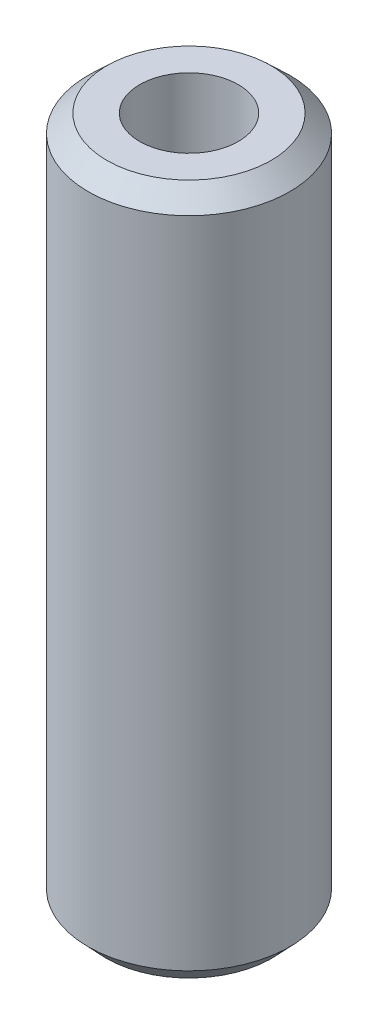
ISO-10303-21;
HEADER;
FILE_DESCRIPTION(('STEP AP214'),'2;1');
FILE_NAME('part.step','',(''),(''),'','','');
FILE_SCHEMA(('AUTOMOTIVE_DESIGN { 1 0 10303 214 1 1 1 1 }'));
ENDSEC;
DATA;
#1=APPLICATION_CONTEXT('core data for automotive mechanical design processes');
#2=APPLICATION_PROTOCOL_DEFINITION('international standard','automotive_design',2000,#1);
#3=PRODUCT_CONTEXT('',#1,'mechanical');
#4=PRODUCT('Part','Part','',(#3));
#5=PRODUCT_RELATED_PRODUCT_CATEGORY('part','',(#4));
#6=PRODUCT_DEFINITION_FORMATION('','',#4);
#7=PRODUCT_DEFINITION_CONTEXT('part definition',#1,'design');
#8=PRODUCT_DEFINITION('design','',#6,#7);
#9=PRODUCT_DEFINITION_SHAPE('','',#8);
#10=(LENGTH_UNIT() NAMED_UNIT(*) SI_UNIT(.MILLI.,.METRE.));
#11=(NAMED_UNIT(*) PLANE_ANGLE_UNIT() SI_UNIT($,.RADIAN.));
#12=(NAMED_UNIT(*) SI_UNIT($,.STERADIAN.) SOLID_ANGLE_UNIT());
#13=UNCERTAINTY_MEASURE_WITH_UNIT(LENGTH_MEASURE(1.E-05),#10,'distance_accuracy_value','');
#14=(GEOMETRIC_REPRESENTATION_CONTEXT(3) GLOBAL_UNCERTAINTY_ASSIGNED_CONTEXT((#13)) GLOBAL_UNIT_ASSIGNED_CONTEXT((#10,
#11,#12)) REPRESENTATION_CONTEXT('',''));
#15=CARTESIAN_POINT('',(0.,0.,0.));
#16=DIRECTION('',(0.,0.,1.));
#17=DIRECTION('',(1.,0.,0.));
#18=AXIS2_PLACEMENT_3D('',#15,#16,#17);
#19=CARTESIAN_POINT('',(0.,102.705654889355,0.));
#20=DIRECTION('',(0.,-1.,0.));
#21=DIRECTION('',(0.,0.,-1.));
#22=AXIS2_PLACEMENT_3D('',#19,#20,#21);
#23=CYLINDRICAL_SURFACE('',#22,15.);
#24=CARTESIAN_POINT('',(0.,100.076653163763,0.));
#25=DIRECTION('',(0.,1.,0.));
#26=DIRECTION('',(0.,0.,1.));
#27=AXIS2_PLACEMENT_3D('',#24,#25,#26);
#28=CIRCLE('',#27,15.);
#29=CARTESIAN_POINT('',(0.,100.076653163763,15.));
#30=VERTEX_POINT('',#29);
#31=EDGE_CURVE('E50',#30,#30,#28,.F.);
#32=ORIENTED_EDGE('',*,*,#31,.T.);
#33=EDGE_LOOP('',(#32));
#34=FACE_BOUND('',#33,.T.);
#35=CARTESIAN_POINT('',(0.,2.78154389514559,0.));
#36=DIRECTION('',(0.,1.,0.));
#37=DIRECTION('',(0.,0.,1.));
#38=AXIS2_PLACEMENT_3D('',#35,#36,#37);
#39=CIRCLE('',#38,15.);
#40=CARTESIAN_POINT('',(0.,2.78154389514559,15.));
#41=VERTEX_POINT('',#40);
#42=EDGE_CURVE('E51',#41,#41,#39,.T.);
#43=ORIENTED_EDGE('',*,*,#42,.T.);
#44=EDGE_LOOP('',(#43));
#45=FACE_BOUND('',#44,.T.);
#46=ADVANCED_FACE('F39',(#34,#45),#23,.T.);
#47=CARTESIAN_POINT('',(0.,102.705654889355,0.));
#48=DIRECTION('',(0.,1.,0.));
#49=DIRECTION('',(0.,0.,1.));
#50=AXIS2_PLACEMENT_3D('',#47,#48,#49);
#51=PLANE('',#50);
#52=CARTESIAN_POINT('',(0.,102.705654889355,0.));
#53=DIRECTION('',(0.,1.,0.));
#54=DIRECTION('',(0.,0.,1.));
#55=AXIS2_PLACEMENT_3D('',#52,#53,#54);
#56=CIRCLE('',#55,12.2184561048544);
#57=CARTESIAN_POINT('',(0.,102.705654889355,12.2184561048544));
#58=VERTEX_POINT('',#57);
#59=EDGE_CURVE('E54',#58,#58,#56,.T.);
#60=ORIENTED_EDGE('',*,*,#59,.T.);
#61=EDGE_LOOP('',(#60));
#62=FACE_BOUND('',#61,.T.);
#63=CARTESIAN_POINT('',(0.,102.705654889355,0.));
#64=DIRECTION('',(0.,1.,0.));
#65=DIRECTION('',(0.,0.,1.));
#66=AXIS2_PLACEMENT_3D('',#63,#64,#65);
#67=CIRCLE('',#66,7.33713232869713);
#68=CARTESIAN_POINT('',(0.,102.705654889355,7.33713232869713));
#69=VERTEX_POINT('',#68);
#70=EDGE_CURVE('E58',#69,#69,#67,.T.);
#71=ORIENTED_EDGE('',*,*,#70,.F.);
#72=EDGE_LOOP('',(#71));
#73=FACE_BOUND('',#72,.T.);
#74=ADVANCED_FACE('F69',(#62,#73),#51,.T.);
#75=CARTESIAN_POINT('',(0.,0.,0.));
#76=DIRECTION('',(0.,1.,0.));
#77=DIRECTION('',(0.,0.,1.));
#78=AXIS2_PLACEMENT_3D('',#75,#76,#77);
#79=PLANE('',#78);
#80=CARTESIAN_POINT('',(0.,0.,0.));
#81=DIRECTION('',(0.,1.,0.));
#82=DIRECTION('',(0.,0.,1.));
#83=AXIS2_PLACEMENT_3D('',#80,#81,#82);
#84=CIRCLE('',#83,12.3709982744074);
#85=CARTESIAN_POINT('',(0.,0.,12.3709982744074));
#86=VERTEX_POINT('',#85);
#87=EDGE_CURVE('E10',#86,#86,#84,.F.);
#88=ORIENTED_EDGE('',*,*,#87,.T.);
#89=EDGE_LOOP('',(#88));
#90=FACE_BOUND('',#89,.T.);
#91=CARTESIAN_POINT('',(0.,0.,0.));
#92=DIRECTION('',(0.,1.,0.));
#93=DIRECTION('',(0.,0.,1.));
#94=AXIS2_PLACEMENT_3D('',#91,#92,#93);
#95=CIRCLE('',#94,7.33713232869713);
#96=CARTESIAN_POINT('',(0.,0.,7.33713232869713));
#97=VERTEX_POINT('',#96);
#98=EDGE_CURVE('E63',#97,#97,#95,.T.);
#99=ORIENTED_EDGE('',*,*,#98,.T.);
#100=EDGE_LOOP('',(#99));
#101=FACE_BOUND('',#100,.T.);
#102=ADVANCED_FACE('F75',(#90,#101),#79,.F.);
#103=CARTESIAN_POINT('',(0.,102.705654889355,0.));
#104=DIRECTION('',(0.,-1.,0.));
#105=DIRECTION('',(0.,0.,-1.));
#106=AXIS2_PLACEMENT_3D('',#103,#104,#105);
#107=CYLINDRICAL_SURFACE('',#106,7.33713232869713);
#108=ORIENTED_EDGE('',*,*,#70,.T.);
#109=EDGE_LOOP('',(#108));
#110=FACE_BOUND('',#109,.T.);
#111=ORIENTED_EDGE('',*,*,#98,.F.);
#112=EDGE_LOOP('',(#111));
#113=FACE_BOUND('',#112,.T.);
#114=ADVANCED_FACE('F70',(#110,#113),#107,.F.);
#115=CARTESIAN_POINT('',(0.,102.705654889355,0.));
#116=DIRECTION('',(0.,-1.,0.));
#117=DIRECTION('',(0.,0.,-1.));
#118=AXIS2_PLACEMENT_3D('',#115,#116,#117);
#119=CONICAL_SURFACE('',#118,12.2184561048544,0.813584187930594);
#120=ORIENTED_EDGE('',*,*,#31,.F.);
#121=EDGE_LOOP('',(#120));
#122=FACE_BOUND('',#121,.T.);
#123=ORIENTED_EDGE('',*,*,#59,.F.);
#124=EDGE_LOOP('',(#123));
#125=FACE_BOUND('',#124,.T.);
#126=ADVANCED_FACE('F81',(#122,#125),#119,.T.);
#127=CARTESIAN_POINT('',(0.,2.78154389514559,0.));
#128=DIRECTION('',(0.,1.,0.));
#129=DIRECTION('',(0.,0.,1.));
#130=AXIS2_PLACEMENT_3D('',#127,#128,#129);
#131=CONICAL_SURFACE('',#130,15.,0.757212138864303);
#132=CARTESIAN_POINT('',(0.,0.,12.3709982744074));
#133=CARTESIAN_POINT('',(0.,0.0289744155744326,12.398383709049));
#134=CARTESIAN_POINT('',(0.,0.0579488311488659,12.4257691436906));
#135=CARTESIAN_POINT('',(0.,0.115897662297733,12.4805400129738));
#136=CARTESIAN_POINT('',(0.,0.144872077872166,12.5079254476153));
#137=CARTESIAN_POINT('',(0.,0.202820909021032,12.5626963168985));
#138=CARTESIAN_POINT('',(0.,0.231795324595466,12.5900817515401));
#139=CARTESIAN_POINT('',(0.,0.289744155744332,12.6448526208233));
#140=CARTESIAN_POINT('',(0.,0.318718571318766,12.6722380554649));
#141=CARTESIAN_POINT('',(0.,0.376667402467632,12.7270089247481));
#142=CARTESIAN_POINT('',(0.,0.405641818042065,12.7543943593896));
#143=CARTESIAN_POINT('',(0.,0.463590649190932,12.8091652286728));
#144=CARTESIAN_POINT('',(0.,0.492565064765365,12.8365506633144));
#145=CARTESIAN_POINT('',(0.,0.550513895914232,12.8913215325976));
#146=CARTESIAN_POINT('',(0.,0.579488311488665,12.9187069672392));
#147=CARTESIAN_POINT('',(0.,0.637437142637531,12.9734778365224));
#148=CARTESIAN_POINT('',(0.,0.666411558211965,13.000863271164));
#149=CARTESIAN_POINT('',(0.,0.724360389360831,13.0556341404471));
#150=CARTESIAN_POINT('',(0.,0.753334804935265,13.0830195750887));
#151=CARTESIAN_POINT('',(0.,0.811283636084131,13.1377904443719));
#152=CARTESIAN_POINT('',(0.,0.840258051658564,13.1651758790135));
#153=CARTESIAN_POINT('',(0.,0.898206882807431,13.2199467482967));
#154=CARTESIAN_POINT('',(0.,0.927181298381864,13.2473321829383));
#155=CARTESIAN_POINT('',(0.,0.985130129530731,13.3021030522214));
#156=CARTESIAN_POINT('',(0.,1.01410454510516,13.329488486863));
#157=CARTESIAN_POINT('',(0.,1.07205337625403,13.3842593561462));
#158=CARTESIAN_POINT('',(0.,1.10102779182846,13.4116447907878));
#159=CARTESIAN_POINT('',(0.,1.15897662297733,13.466415660071));
#160=CARTESIAN_POINT('',(0.,1.18795103855176,13.4938010947126));
#161=CARTESIAN_POINT('',(0.,1.24589986970063,13.5485719639957));
#162=CARTESIAN_POINT('',(0.,1.27487428527506,13.5759573986373));
#163=CARTESIAN_POINT('',(0.,1.33282311642393,13.6307282679205));
#164=CARTESIAN_POINT('',(0.,1.36179753199836,13.6581137025621));
#165=CARTESIAN_POINT('',(0.,1.41974636314723,13.7128845718453));
#166=CARTESIAN_POINT('',(0.,1.44872077872166,13.7402700064869));
#167=CARTESIAN_POINT('',(0.,1.50666960987053,13.7950408757701));
#168=CARTESIAN_POINT('',(0.,1.53564402544496,13.8224263104116));
#169=CARTESIAN_POINT('',(0.,1.59359285659383,13.8771971796948));
#170=CARTESIAN_POINT('',(0.,1.62256727216826,13.9045826143364));
#171=CARTESIAN_POINT('',(0.,1.68051610331713,13.9593534836196));
#172=CARTESIAN_POINT('',(0.,1.70949051889156,13.9867389182612));
#173=CARTESIAN_POINT('',(0.,1.76743935004043,14.0415097875444));
#174=CARTESIAN_POINT('',(0.,1.79641376561486,14.0688952221859));
#175=CARTESIAN_POINT('',(0.,1.85436259676373,14.1236660914691));
#176=CARTESIAN_POINT('',(0.,1.88333701233816,14.1510515261107));
#177=CARTESIAN_POINT('',(0.,1.94128584348703,14.2058223953939));
#178=CARTESIAN_POINT('',(0.,1.97026025906146,14.2332078300355));
#179=CARTESIAN_POINT('',(0.,2.02820909021033,14.2879786993187));
#180=CARTESIAN_POINT('',(0.,2.05718350578476,14.3153641339603));
#181=CARTESIAN_POINT('',(0.,2.11513233693363,14.3701350032434));
#182=CARTESIAN_POINT('',(0.,2.14410675250806,14.397520437885));
#183=CARTESIAN_POINT('',(0.,2.20205558365693,14.4522913071682));
#184=CARTESIAN_POINT('',(0.,2.23102999923136,14.4796767418098));
#185=CARTESIAN_POINT('',(0.,2.28897883038023,14.534447611093));
#186=CARTESIAN_POINT('',(0.,2.31795324595466,14.5618330457346));
#187=CARTESIAN_POINT('',(0.,2.37590207710353,14.6166039150177));
#188=CARTESIAN_POINT('',(0.,2.40487649267796,14.6439893496593));
#189=CARTESIAN_POINT('',(0.,2.46282532382683,14.6987602189425));
#190=CARTESIAN_POINT('',(0.,2.49179973940126,14.7261456535841));
#191=CARTESIAN_POINT('',(0.,2.54974857055013,14.7809165228673));
#192=CARTESIAN_POINT('',(0.,2.57872298612456,14.8083019575089));
#193=CARTESIAN_POINT('',(0.,2.63667181727343,14.8630728267921));
#194=CARTESIAN_POINT('',(0.,2.66564623284786,14.8904582614336));
#195=CARTESIAN_POINT('',(0.,2.72359506399673,14.9452291307168));
#196=CARTESIAN_POINT('',(0.,2.75256947957116,14.9726145653584));
#197=CARTESIAN_POINT('',(0.,2.78154389514559,15.));
#198=B_SPLINE_CURVE_WITH_KNOTS('',3,(#132,#133,#134,#135,#136,#137,#138,#139,#140,#141,#142,
#143,#144,#145,#146,#147,#148,#149,#150,#151,#152,#153,#154,#155,#156,#157,#158,#159,#160,#161,
#162,#163,#164,#165,#166,#167,#168,#169,#170,#171,#172,#173,#174,#175,#176,#177,#178,#179,#180,
#181,#182,#183,#184,#185,#186,#187,#188,#189,#190,#191,#192,#193,#194,#195,#196,#197),
.UNSPECIFIED.,.F.,.F.,(4,2,2,2,2,2,2,2,2,2,2,2,2,2,2,2,2,2,2,2,2,2,2,2,2,2,2,2,2,2,2,2,4),(0.,
0.119604803814475,0.239209607628948,0.358814411443421,0.478419215257894,0.598024019072368,
0.717628822886841,0.837233626701315,0.956838430515788,1.07644323433026,1.19604803814473,
1.31565284195921,1.43525764577368,1.55486244958815,1.67446725340263,1.7940720572171,
1.91367686103157,2.03328166484605,2.15288646866052,2.27249127247499,2.39209607628947,
2.51170088010394,2.63130568391842,2.75091048773289,2.87051529154736,2.99012009536184,
3.10972489917631,3.22932970299078,3.34893450680526,3.46853931061973,3.5881441144342,
3.70774891824868,3.82735372206315),.UNSPECIFIED.);
#199=EDGE_CURVE('BSEAM45',#86,#41,#198,.T.);
#200=ORIENTED_EDGE('',*,*,#87,.F.);
#201=ORIENTED_EDGE('',*,*,#42,.F.);
#202=ORIENTED_EDGE('',*,*,#199,.T.);
#203=ORIENTED_EDGE('',*,*,#199,.F.);
#204=EDGE_LOOP('',(#200,#202,#201,#203));
#205=FACE_BOUND('',#204,.T.);
#206=ADVANCED_FACE('F45',(#205),#131,.T.);
#207=CLOSED_SHELL('',(#46,#74,#102,#114,#126,#206));
#208=MANIFOLD_SOLID_BREP('B2',#207);
#209=ADVANCED_BREP_SHAPE_REPRESENTATION('',(#18,#208),#14);
#210=SHAPE_DEFINITION_REPRESENTATION(#9,#209);
ENDSEC;
END-ISO-10303-21;
